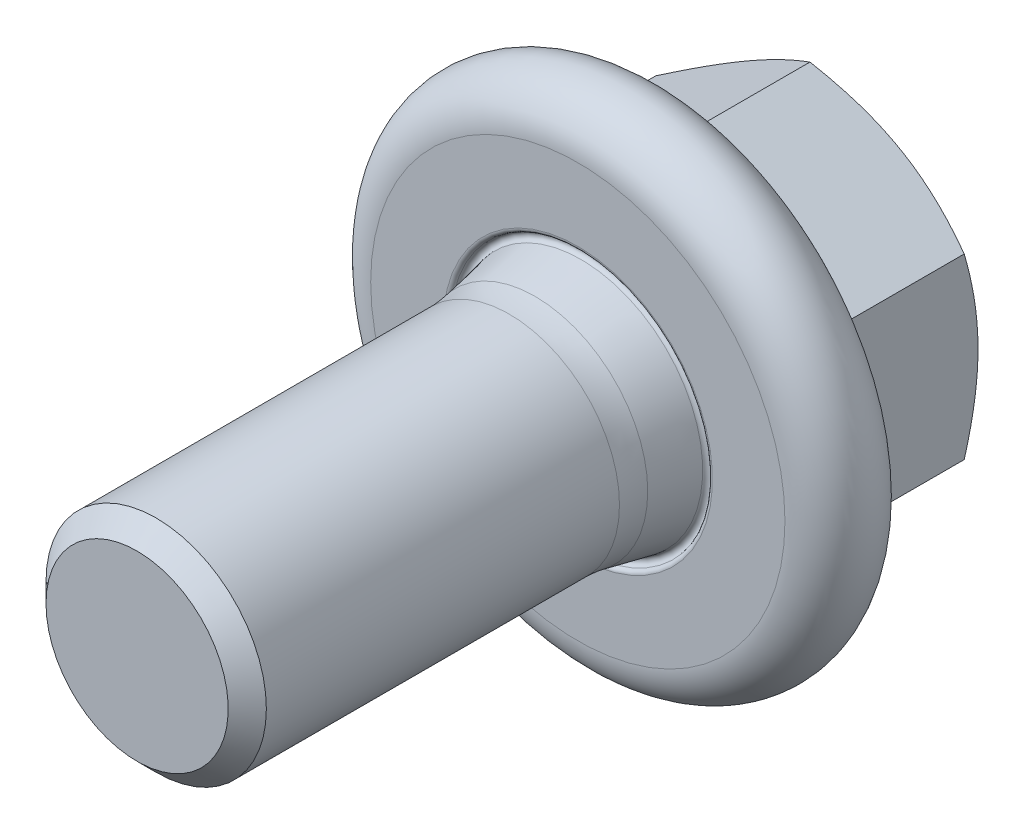
ISO-10303-21;
HEADER;
FILE_DESCRIPTION(('STEP AP214'),'2;1');
FILE_NAME('part.step','',(''),(''),'','','');
FILE_SCHEMA(('AUTOMOTIVE_DESIGN { 1 0 10303 214 1 1 1 1 }'));
ENDSEC;
DATA;
#1=APPLICATION_CONTEXT('core data for automotive mechanical design processes');
#2=APPLICATION_PROTOCOL_DEFINITION('international standard','automotive_design',2000,#1);
#3=PRODUCT_CONTEXT('',#1,'mechanical');
#4=PRODUCT('Part','Part','',(#3));
#5=PRODUCT_RELATED_PRODUCT_CATEGORY('part','',(#4));
#6=PRODUCT_DEFINITION_FORMATION('','',#4);
#7=PRODUCT_DEFINITION_CONTEXT('part definition',#1,'design');
#8=PRODUCT_DEFINITION('design','',#6,#7);
#9=PRODUCT_DEFINITION_SHAPE('','',#8);
#10=(LENGTH_UNIT() NAMED_UNIT(*) SI_UNIT(.MILLI.,.METRE.));
#11=(NAMED_UNIT(*) PLANE_ANGLE_UNIT() SI_UNIT($,.RADIAN.));
#12=(NAMED_UNIT(*) SI_UNIT($,.STERADIAN.) SOLID_ANGLE_UNIT());
#13=UNCERTAINTY_MEASURE_WITH_UNIT(LENGTH_MEASURE(1.E-05),#10,'distance_accuracy_value','');
#14=(GEOMETRIC_REPRESENTATION_CONTEXT(3) GLOBAL_UNCERTAINTY_ASSIGNED_CONTEXT((#13)) GLOBAL_UNIT_ASSIGNED_CONTEXT((#10,
#11,#12)) REPRESENTATION_CONTEXT('',''));
#15=CARTESIAN_POINT('',(0.,0.,0.));
#16=DIRECTION('',(0.,0.,1.));
#17=DIRECTION('',(1.,0.,0.));
#18=AXIS2_PLACEMENT_3D('',#15,#16,#17);
#19=CARTESIAN_POINT('',(175.672364397833,223.124440488105,-57.1634222254516));
#20=DIRECTION('',(-0.5,0.866025403784439,0.));
#21=DIRECTION('',(-0.866025403784439,-0.5,0.));
#22=AXIS2_PLACEMENT_3D('',#19,#20,#21);
#23=PLANE('',#22);
#24=CARTESIAN_POINT('',(177.422364397832,224.134803459186,-56.1672919098644));
#25=CARTESIAN_POINT('',(177.277421681038,224.051120742628,-56.1977599453541));
#26=CARTESIAN_POINT('',(177.132001035496,223.967162093779,-56.2254757929783));
#27=CARTESIAN_POINT('',(176.840214294002,223.798698940031,-56.2742374115386));
#28=CARTESIAN_POINT('',(176.693847549201,223.71419406052,-56.295277964156));
#29=CARTESIAN_POINT('',(176.40179278474,223.54557616364,-56.3293104094448));
#30=CARTESIAN_POINT('',(176.256111433559,223.46146699632,-56.3423765251649));
#31=CARTESIAN_POINT('',(175.964408088679,223.29305199163,-56.3599018466276));
#32=CARTESIAN_POINT('',(175.818386243256,223.208746239868,-56.3643642790468));
#33=CARTESIAN_POINT('',(175.526342552409,223.040134736342,-56.3643642790468));
#34=CARTESIAN_POINT('',(175.380320706986,222.955828984579,-56.3599018466276));
#35=CARTESIAN_POINT('',(175.088617362106,222.787413979889,-56.3423765251649));
#36=CARTESIAN_POINT('',(174.942936010925,222.703304812569,-56.3293104094448));
#37=CARTESIAN_POINT('',(174.650881246464,222.53468691569,-56.295277964156));
#38=CARTESIAN_POINT('',(174.504514501663,222.450182036178,-56.2742374115386));
#39=CARTESIAN_POINT('',(174.212727760169,222.281718882431,-56.2254757929783));
#40=CARTESIAN_POINT('',(174.067307114627,222.197760233581,-56.1977599453541));
#41=CARTESIAN_POINT('',(173.922364397833,222.114077517023,-56.1672919098643));
#42=B_SPLINE_CURVE_WITH_KNOTS('',3,(#24,#25,#26,#27,#28,#29,#30,#31,#32,#33,#34,#35,#36,#37,#38,
#39,#40,#41),.UNSPECIFIED.,.F.,.F.,(4,2,2,2,2,2,2,2,4),(0.,0.510400948319084,1.02119991788158,
1.52716902069188,2.03294833077693,2.538727640862,3.04469674367226,3.55549571323478,
4.06589666155388),.UNSPECIFIED.);
#43=CARTESIAN_POINT('',(177.422364397833,224.134803459186,-56.1672919098645));
#44=VERTEX_POINT('',#43);
#45=CARTESIAN_POINT('',(173.922364397833,222.114077517023,-56.1672919098644));
#46=VERTEX_POINT('',#45);
#47=EDGE_CURVE('E41',#44,#46,#42,.T.);
#48=ORIENTED_EDGE('',*,*,#47,.F.);
#49=DIRECTION('',(0.,0.,-1.));
#50=VECTOR('',#49,1.);
#51=CARTESIAN_POINT('',(177.422364397833,224.134803459186,-54.8634222254516));
#52=LINE('',#51,#50);
#53=CARTESIAN_POINT('',(177.422364397833,224.134803459186,-59.1306075748604));
#54=VERTEX_POINT('',#53);
#55=EDGE_CURVE('E11',#44,#54,#52,.T.);
#56=ORIENTED_EDGE('',*,*,#55,.T.);
#57=CARTESIAN_POINT('',(177.422364397832,224.134803459186,-59.1306075748602));
#58=CARTESIAN_POINT('',(177.268560594597,224.046004791986,-59.1818903708886));
#59=CARTESIAN_POINT('',(177.11342915912,223.956439615954,-59.2285293899348));
#60=CARTESIAN_POINT('',(176.800480291132,223.775758502778,-59.3099363969098));
#61=CARTESIAN_POINT('',(176.642657299934,223.684639356326,-59.3446755892685));
#62=CARTESIAN_POINT('',(176.328967138754,223.503530257327,-59.3987496467045));
#63=CARTESIAN_POINT('',(176.173148220504,223.41356816293,-59.4184444465656));
#64=CARTESIAN_POINT('',(175.860777587024,223.233220893603,-59.4419515306319));
#65=CARTESIAN_POINT('',(175.704227006398,223.142836373737,-59.4457832854053));
#66=CARTESIAN_POINT('',(175.41172904084,222.973962594585,-59.4377915670893));
#67=CARTESIAN_POINT('',(175.275737764206,222.895447994413,-59.4279303257317));
#68=CARTESIAN_POINT('',(175.004641149744,222.738930291077,-59.3966822986034));
#69=CARTESIAN_POINT('',(174.869536748868,222.660927728862,-59.375284849015));
#70=CARTESIAN_POINT('',(174.597881649815,222.504087584297,-59.3217953665181));
#71=CARTESIAN_POINT('',(174.461365315912,222.425269842169,-59.2894767009781));
#72=CARTESIAN_POINT('',(174.190368200324,222.268809584535,-59.2161269933913));
#73=CARTESIAN_POINT('',(174.055883949532,222.191165066139,-59.1751131745438));
#74=CARTESIAN_POINT('',(173.922364397833,222.114077517023,-59.1306075748602));
#75=B_SPLINE_CURVE_WITH_KNOTS('',3,(#57,#58,#59,#60,#61,#62,#63,#64,#65,#66,#67,#68,#69,#70,#71,
#72,#73,#74),.UNSPECIFIED.,.F.,.F.,(4,2,2,2,2,2,2,2,4),(0.,0.554778020224452,1.11088917979738,
1.65323831076753,2.19492155557112,2.66648861960565,3.13849233913992,3.62096283935476,
4.10248645365063),.UNSPECIFIED.);
#76=CARTESIAN_POINT('',(173.922364397833,222.114077517023,-59.1306075748603));
#77=VERTEX_POINT('',#76);
#78=EDGE_CURVE('E33',#54,#77,#75,.T.);
#79=ORIENTED_EDGE('',*,*,#78,.T.);
#80=DIRECTION('',(0.,0.,-1.));
#81=VECTOR('',#80,1.);
#82=CARTESIAN_POINT('',(173.922364397833,222.114077517023,-54.8634222254516));
#83=LINE('',#82,#81);
#84=EDGE_CURVE('E148',#46,#77,#83,.T.);
#85=ORIENTED_EDGE('',*,*,#84,.F.);
#86=EDGE_LOOP('',(#48,#56,#79,#85));
#87=FACE_BOUND('',#86,.T.);
#88=ADVANCED_FACE('F17',(#87),#23,.T.);
#89=CARTESIAN_POINT('',(173.922364397833,220.093351574859,-57.1634222254516));
#90=DIRECTION('',(-1.,0.,0.));
#91=DIRECTION('',(0.,-1.,0.));
#92=AXIS2_PLACEMENT_3D('',#89,#90,#91);
#93=PLANE('',#92);
#94=CARTESIAN_POINT('',(173.922364397833,222.114077517023,-56.1672919098644));
#95=CARTESIAN_POINT('',(173.922364397833,221.946712083907,-56.1977599453542));
#96=CARTESIAN_POINT('',(173.922364397833,221.778794786208,-56.2254757929784));
#97=CARTESIAN_POINT('',(173.922364397833,221.441868478712,-56.2742374115387));
#98=CARTESIAN_POINT('',(173.922364397833,221.27285871969,-56.2952779641561));
#99=CARTESIAN_POINT('',(173.922364397833,220.93562292593,-56.3293104094449));
#100=CARTESIAN_POINT('',(173.922364397833,220.76740459129,-56.342376525165));
#101=CARTESIAN_POINT('',(173.922364397833,220.43057458191,-56.3599018466277));
#102=CARTESIAN_POINT('',(173.922364397833,220.261963078385,-56.364364279047));
#103=CARTESIAN_POINT('',(173.922364397833,219.924740071333,-56.364364279047));
#104=CARTESIAN_POINT('',(173.922364397833,219.756128567808,-56.3599018466277));
#105=CARTESIAN_POINT('',(173.922364397833,219.419298558428,-56.342376525165));
#106=CARTESIAN_POINT('',(173.922364397833,219.251080223788,-56.3293104094449));
#107=CARTESIAN_POINT('',(173.922364397833,218.913844430028,-56.2952779641561));
#108=CARTESIAN_POINT('',(173.922364397833,218.744834671006,-56.2742374115387));
#109=CARTESIAN_POINT('',(173.922364397833,218.40790836351,-56.2254757929784));
#110=CARTESIAN_POINT('',(173.922364397833,218.239991065811,-56.1977599453542));
#111=CARTESIAN_POINT('',(173.922364397833,218.072625632695,-56.1672919098644));
#112=B_SPLINE_CURVE_WITH_KNOTS('',3,(#94,#95,#96,#97,#98,#99,#100,#101,#102,#103,#104,#105,#106,
#107,#108,#109,#110,#111),.UNSPECIFIED.,.F.,.F.,(4,2,2,2,2,2,2,2,4),(0.,0.510400948319248,
1.02119991788192,1.52716902069235,2.03294833077754,2.53872764086272,3.04469674367312,
3.5554957132358,4.06589666155504),.UNSPECIFIED.);
#113=CARTESIAN_POINT('',(173.922364397833,218.072625632695,-56.1672919098644));
#114=VERTEX_POINT('',#113);
#115=EDGE_CURVE('E255',#46,#114,#112,.T.);
#116=ORIENTED_EDGE('',*,*,#115,.F.);
#117=ORIENTED_EDGE('',*,*,#84,.T.);
#118=CARTESIAN_POINT('',(173.922364397833,222.114077517023,-59.1306075748603));
#119=CARTESIAN_POINT('',(173.922364397833,221.936480182622,-59.1818903708887));
#120=CARTESIAN_POINT('',(173.922364397833,221.757349830558,-59.2285293899349));
#121=CARTESIAN_POINT('',(173.922364397833,221.395987604206,-59.3099363969099));
#122=CARTESIAN_POINT('',(173.922364397833,221.213749311302,-59.3446755892687));
#123=CARTESIAN_POINT('',(173.922364397833,220.851531113303,-59.3987496467047));
#124=CARTESIAN_POINT('',(173.922364397833,220.671606924509,-59.4184444465658));
#125=CARTESIAN_POINT('',(173.922364397833,220.310912385856,-59.4419515306321));
#126=CARTESIAN_POINT('',(173.922364397833,220.130143346124,-59.4457832854055));
#127=CARTESIAN_POINT('',(173.922364397833,219.79239578782,-59.4377915670895));
#128=CARTESIAN_POINT('',(173.922364397833,219.635366587475,-59.4279303257319));
#129=CARTESIAN_POINT('',(173.922364397833,219.322331180803,-59.3966822986036));
#130=CARTESIAN_POINT('',(173.922364397833,219.166326056374,-59.3752848490152));
#131=CARTESIAN_POINT('',(173.922364397833,218.852645767243,-59.3217953665183));
#132=CARTESIAN_POINT('',(173.922364397833,218.695010282988,-59.2894767009783));
#133=CARTESIAN_POINT('',(173.922364397833,218.38208976772,-59.2161269933915));
#134=CARTESIAN_POINT('',(173.922364397833,218.226800730926,-59.175113174544));
#135=CARTESIAN_POINT('',(173.922364397833,218.072625632695,-59.1306075748603));
#136=B_SPLINE_CURVE_WITH_KNOTS('',3,(#118,#119,#120,#121,#122,#123,#124,#125,#126,#127,#128,
#129,#130,#131,#132,#133,#134,#135),.UNSPECIFIED.,.F.,.F.,(4,2,2,2,2,2,2,2,4),(0.,
0.554778020224542,1.11088917979751,1.65323831076771,2.19492155557136,2.66648861960611,
3.1384923391406,3.62096283935568,4.10248645365181),.UNSPECIFIED.);
#137=CARTESIAN_POINT('',(173.922364397833,218.072625632695,-59.1306075748603));
#138=VERTEX_POINT('',#137);
#139=EDGE_CURVE('E150',#77,#138,#136,.T.);
#140=ORIENTED_EDGE('',*,*,#139,.T.);
#141=DIRECTION('',(0.,0.,-1.));
#142=VECTOR('',#141,1.);
#143=CARTESIAN_POINT('',(173.922364397833,218.072625632695,-54.8634222254516));
#144=LINE('',#143,#142);
#145=EDGE_CURVE('E159',#114,#138,#144,.T.);
#146=ORIENTED_EDGE('',*,*,#145,.F.);
#147=EDGE_LOOP('',(#116,#117,#140,#146));
#148=FACE_BOUND('',#147,.T.);
#149=ADVANCED_FACE('F260',(#148),#93,.T.);
#150=CARTESIAN_POINT('',(175.672364397833,217.062262661613,-57.1634222254516));
#151=DIRECTION('',(-0.5,-0.866025403784439,0.));
#152=DIRECTION('',(0.866025403784439,-0.5,0.));
#153=AXIS2_PLACEMENT_3D('',#150,#151,#152);
#154=PLANE('',#153);
#155=CARTESIAN_POINT('',(173.922364397833,218.072625632695,-56.1672919098643));
#156=CARTESIAN_POINT('',(174.067307114627,217.988942916137,-56.1977599453541));
#157=CARTESIAN_POINT('',(174.212727760169,217.904984267287,-56.2254757929783));
#158=CARTESIAN_POINT('',(174.504514501663,217.73652111354,-56.2742374115386));
#159=CARTESIAN_POINT('',(174.650881246464,217.652016234028,-56.295277964156));
#160=CARTESIAN_POINT('',(174.942936010925,217.483398337149,-56.3293104094448));
#161=CARTESIAN_POINT('',(175.088617362106,217.399289169828,-56.3423765251649));
#162=CARTESIAN_POINT('',(175.380320706986,217.230874165139,-56.3599018466276));
#163=CARTESIAN_POINT('',(175.52634255241,217.146568413376,-56.3643642790468));
#164=CARTESIAN_POINT('',(175.818386243256,216.97795690985,-56.3643642790468));
#165=CARTESIAN_POINT('',(175.96440808868,216.893651158087,-56.3599018466275));
#166=CARTESIAN_POINT('',(176.25611143356,216.725236153398,-56.3423765251649));
#167=CARTESIAN_POINT('',(176.401792784741,216.641126986077,-56.3293104094448));
#168=CARTESIAN_POINT('',(176.693847549202,216.472509089198,-56.2952779641559));
#169=CARTESIAN_POINT('',(176.840214294003,216.388004209686,-56.2742374115385));
#170=CARTESIAN_POINT('',(177.132001035497,216.219541055939,-56.2254757929782));
#171=CARTESIAN_POINT('',(177.277421681039,216.135582407089,-56.197759945354));
#172=CARTESIAN_POINT('',(177.422364397833,216.051899690531,-56.1672919098643));
#173=B_SPLINE_CURVE_WITH_KNOTS('',3,(#155,#156,#157,#158,#159,#160,#161,#162,#163,#164,#165,
#166,#167,#168,#169,#170,#171,#172),.UNSPECIFIED.,.F.,.F.,(4,2,2,2,2,2,2,2,4),(0.,
0.510400948319208,1.02119991788178,1.52716902069214,2.03294833077729,2.53872764086245,
3.04469674367281,3.55549571323537,4.06589666155458),.UNSPECIFIED.);
#174=CARTESIAN_POINT('',(177.422364397833,216.051899690531,-56.1672919098642));
#175=VERTEX_POINT('',#174);
#176=EDGE_CURVE('E228',#114,#175,#173,.T.);
#177=ORIENTED_EDGE('',*,*,#176,.F.);
#178=ORIENTED_EDGE('',*,*,#145,.T.);
#179=CARTESIAN_POINT('',(173.922364397833,218.072625632695,-59.1306075748602));
#180=CARTESIAN_POINT('',(174.076168201068,217.983826965495,-59.1818903708886));
#181=CARTESIAN_POINT('',(174.231299636545,217.894261789462,-59.2285293899348));
#182=CARTESIAN_POINT('',(174.544248504534,217.713580676286,-59.3099363969097));
#183=CARTESIAN_POINT('',(174.702071495731,217.622461529834,-59.3446755892685));
#184=CARTESIAN_POINT('',(175.015761656911,217.441352430835,-59.3987496467045));
#185=CARTESIAN_POINT('',(175.171580575162,217.351390336438,-59.4184444465656));
#186=CARTESIAN_POINT('',(175.483951208642,217.171043067112,-59.4419515306319));
#187=CARTESIAN_POINT('',(175.640501789267,217.080658547245,-59.4457832854053));
#188=CARTESIAN_POINT('',(175.932999754825,216.911784768093,-59.4377915670893));
#189=CARTESIAN_POINT('',(176.06899103146,216.833270167921,-59.4279303257317));
#190=CARTESIAN_POINT('',(176.340087645921,216.676752464585,-59.3966822986034));
#191=CARTESIAN_POINT('',(176.475192046797,216.598749902371,-59.3752848490149));
#192=CARTESIAN_POINT('',(176.746847145851,216.441909757805,-59.321795366518));
#193=CARTESIAN_POINT('',(176.883363479754,216.363092015677,-59.2894767009781));
#194=CARTESIAN_POINT('',(177.154360595342,216.206631758043,-59.2161269933912));
#195=CARTESIAN_POINT('',(177.288844846134,216.128987239647,-59.1751131745437));
#196=CARTESIAN_POINT('',(177.422364397833,216.051899690531,-59.1306075748601));
#197=B_SPLINE_CURVE_WITH_KNOTS('',3,(#179,#180,#181,#182,#183,#184,#185,#186,#187,#188,#189,
#190,#191,#192,#193,#194,#195,#196),.UNSPECIFIED.,.F.,.F.,(4,2,2,2,2,2,2,2,4),(0.,
0.554778020224571,1.11088917979756,1.6532383107678,2.19492155557139,2.66648861960602,
3.13849233914041,3.62096283935532,4.10248645365134),.UNSPECIFIED.);
#198=CARTESIAN_POINT('',(177.422364397833,216.051899690531,-59.1306075748601));
#199=VERTEX_POINT('',#198);
#200=EDGE_CURVE('E158',#138,#199,#197,.T.);
#201=ORIENTED_EDGE('',*,*,#200,.T.);
#202=DIRECTION('',(0.,0.,-1.));
#203=VECTOR('',#202,1.);
#204=CARTESIAN_POINT('',(177.422364397833,216.051899690531,-54.8634222254516));
#205=LINE('',#204,#203);
#206=EDGE_CURVE('E156',#175,#199,#205,.T.);
#207=ORIENTED_EDGE('',*,*,#206,.F.);
#208=EDGE_LOOP('',(#177,#178,#201,#207));
#209=FACE_BOUND('',#208,.T.);
#210=ADVANCED_FACE('F219',(#209),#154,.T.);
#211=CARTESIAN_POINT('',(179.172364397833,217.062262661613,-57.1634222254516));
#212=DIRECTION('',(0.5,-0.866025403784439,0.));
#213=DIRECTION('',(0.866025403784439,0.5,0.));
#214=AXIS2_PLACEMENT_3D('',#211,#212,#213);
#215=PLANE('',#214);
#216=CARTESIAN_POINT('',(177.422364397833,216.051899690531,-56.1672919098643));
#217=CARTESIAN_POINT('',(177.567307114627,216.135582407089,-56.197759945354));
#218=CARTESIAN_POINT('',(177.712727760169,216.219541055939,-56.2254757929782));
#219=CARTESIAN_POINT('',(178.004514501663,216.388004209686,-56.2742374115385));
#220=CARTESIAN_POINT('',(178.150881246464,216.472509089198,-56.2952779641559));
#221=CARTESIAN_POINT('',(178.442936010925,216.641126986077,-56.3293104094448));
#222=CARTESIAN_POINT('',(178.588617362106,216.725236153398,-56.3423765251649));
#223=CARTESIAN_POINT('',(178.880320706986,216.893651158087,-56.3599018466275));
#224=CARTESIAN_POINT('',(179.02634255241,216.97795690985,-56.3643642790468));
#225=CARTESIAN_POINT('',(179.318386243256,217.146568413376,-56.3643642790468));
#226=CARTESIAN_POINT('',(179.46440808868,217.230874165139,-56.3599018466276));
#227=CARTESIAN_POINT('',(179.75611143356,217.399289169828,-56.3423765251649));
#228=CARTESIAN_POINT('',(179.901792784741,217.483398337149,-56.3293104094448));
#229=CARTESIAN_POINT('',(180.193847549202,217.652016234028,-56.295277964156));
#230=CARTESIAN_POINT('',(180.340214294003,217.73652111354,-56.2742374115386));
#231=CARTESIAN_POINT('',(180.632001035497,217.904984267287,-56.2254757929783));
#232=CARTESIAN_POINT('',(180.777421681039,217.988942916137,-56.1977599453541));
#233=CARTESIAN_POINT('',(180.922364397833,218.072625632695,-56.1672919098643));
#234=B_SPLINE_CURVE_WITH_KNOTS('',3,(#216,#217,#218,#219,#220,#221,#222,#223,#224,#225,#226,
#227,#228,#229,#230,#231,#232,#233),.UNSPECIFIED.,.F.,.F.,(4,2,2,2,2,2,2,2,4),(0.,
0.510400948319211,1.02119991788178,1.52716902069214,2.03294833077729,2.53872764086244,
3.0446967436728,3.55549571323537,4.06589666155458),.UNSPECIFIED.);
#235=CARTESIAN_POINT('',(180.922364397833,218.072625632695,-56.1672919098644));
#236=VERTEX_POINT('',#235);
#237=EDGE_CURVE('E64',#175,#236,#234,.T.);
#238=ORIENTED_EDGE('',*,*,#237,.F.);
#239=ORIENTED_EDGE('',*,*,#206,.T.);
#240=CARTESIAN_POINT('',(177.422364397833,216.051899690531,-59.1306075748601));
#241=CARTESIAN_POINT('',(177.576168201068,216.140698357731,-59.1818903708885));
#242=CARTESIAN_POINT('',(177.731299636545,216.230263533764,-59.2285293899347));
#243=CARTESIAN_POINT('',(178.044248504534,216.41094464694,-59.3099363969096));
#244=CARTESIAN_POINT('',(178.202071495731,216.502063793392,-59.3446755892685));
#245=CARTESIAN_POINT('',(178.515761656911,216.683172892391,-59.3987496467045));
#246=CARTESIAN_POINT('',(178.671580575162,216.773134986788,-59.4184444465656));
#247=CARTESIAN_POINT('',(178.983951208642,216.953482256114,-59.4419515306319));
#248=CARTESIAN_POINT('',(179.140501789267,217.043866775981,-59.4457832854053));
#249=CARTESIAN_POINT('',(179.432999754825,217.212740555133,-59.4377915670893));
#250=CARTESIAN_POINT('',(179.56899103146,217.291255155305,-59.4279303257317));
#251=CARTESIAN_POINT('',(179.840087645921,217.447772858641,-59.3966822986034));
#252=CARTESIAN_POINT('',(179.975192046797,217.525775420855,-59.375284849015));
#253=CARTESIAN_POINT('',(180.246847145851,217.682615565421,-59.3217953665181));
#254=CARTESIAN_POINT('',(180.383363479754,217.761433307549,-59.2894767009781));
#255=CARTESIAN_POINT('',(180.654360595342,217.917893565183,-59.2161269933913));
#256=CARTESIAN_POINT('',(180.788844846134,217.995538083579,-59.1751131745438));
#257=CARTESIAN_POINT('',(180.922364397833,218.072625632695,-59.1306075748602));
#258=B_SPLINE_CURVE_WITH_KNOTS('',3,(#240,#241,#242,#243,#244,#245,#246,#247,#248,#249,#250,
#251,#252,#253,#254,#255,#256,#257),.UNSPECIFIED.,.F.,.F.,(4,2,2,2,2,2,2,2,4),(0.,
0.554778020224571,1.11088917979757,1.65323831076781,2.19492155557142,2.66648861960603,
3.13849233914041,3.62096283935532,4.10248645365134),.UNSPECIFIED.);
#259=CARTESIAN_POINT('',(180.922364397833,218.072625632695,-59.1306075748602));
#260=VERTEX_POINT('',#259);
#261=EDGE_CURVE('E155',#199,#260,#258,.T.);
#262=ORIENTED_EDGE('',*,*,#261,.T.);
#263=DIRECTION('',(0.,0.,-1.));
#264=VECTOR('',#263,1.);
#265=CARTESIAN_POINT('',(180.922364397833,218.072625632695,-54.8634222254516));
#266=LINE('',#265,#264);
#267=EDGE_CURVE('E153',#236,#260,#266,.T.);
#268=ORIENTED_EDGE('',*,*,#267,.F.);
#269=EDGE_LOOP('',(#238,#239,#262,#268));
#270=FACE_BOUND('',#269,.T.);
#271=ADVANCED_FACE('F214',(#270),#215,.T.);
#272=CARTESIAN_POINT('',(180.922364397833,220.093351574859,-57.1634222254516));
#273=DIRECTION('',(1.,0.,0.));
#274=DIRECTION('',(0.,1.,0.));
#275=AXIS2_PLACEMENT_3D('',#272,#273,#274);
#276=PLANE('',#275);
#277=CARTESIAN_POINT('',(180.922364397833,218.072625632695,-56.1672919098644));
#278=CARTESIAN_POINT('',(180.922364397833,218.239991065811,-56.1977599453542));
#279=CARTESIAN_POINT('',(180.922364397833,218.40790836351,-56.2254757929784));
#280=CARTESIAN_POINT('',(180.922364397833,218.744834671006,-56.2742374115387));
#281=CARTESIAN_POINT('',(180.922364397833,218.913844430028,-56.2952779641561));
#282=CARTESIAN_POINT('',(180.922364397833,219.251080223788,-56.3293104094449));
#283=CARTESIAN_POINT('',(180.922364397833,219.419298558428,-56.342376525165));
#284=CARTESIAN_POINT('',(180.922364397833,219.756128567808,-56.3599018466277));
#285=CARTESIAN_POINT('',(180.922364397833,219.924740071333,-56.364364279047));
#286=CARTESIAN_POINT('',(180.922364397833,220.261963078385,-56.364364279047));
#287=CARTESIAN_POINT('',(180.922364397833,220.43057458191,-56.3599018466277));
#288=CARTESIAN_POINT('',(180.922364397833,220.76740459129,-56.342376525165));
#289=CARTESIAN_POINT('',(180.922364397833,220.93562292593,-56.3293104094449));
#290=CARTESIAN_POINT('',(180.922364397833,221.27285871969,-56.2952779641561));
#291=CARTESIAN_POINT('',(180.922364397833,221.441868478712,-56.2742374115387));
#292=CARTESIAN_POINT('',(180.922364397833,221.778794786208,-56.2254757929784));
#293=CARTESIAN_POINT('',(180.922364397833,221.946712083907,-56.1977599453542));
#294=CARTESIAN_POINT('',(180.922364397833,222.114077517023,-56.1672919098644));
#295=B_SPLINE_CURVE_WITH_KNOTS('',3,(#277,#278,#279,#280,#281,#282,#283,#284,#285,#286,#287,
#288,#289,#290,#291,#292,#293,#294),.UNSPECIFIED.,.F.,.F.,(4,2,2,2,2,2,2,2,4),(0.,
0.510400948319248,1.02119991788192,1.52716902069233,2.03294833077751,2.53872764086272,
3.04469674367315,3.55549571323582,4.06589666155504),.UNSPECIFIED.);
#296=CARTESIAN_POINT('',(180.922364397833,222.114077517023,-56.1672919098644));
#297=VERTEX_POINT('',#296);
#298=EDGE_CURVE('E21',#236,#297,#295,.T.);
#299=ORIENTED_EDGE('',*,*,#298,.F.);
#300=ORIENTED_EDGE('',*,*,#267,.T.);
#301=CARTESIAN_POINT('',(180.922364397833,218.072625632695,-59.1306075748603));
#302=CARTESIAN_POINT('',(180.922364397833,218.250222967096,-59.1818903708887));
#303=CARTESIAN_POINT('',(180.922364397833,218.42935331916,-59.2285293899349));
#304=CARTESIAN_POINT('',(180.922364397833,218.790715545512,-59.3099363969099));
#305=CARTESIAN_POINT('',(180.922364397833,218.972953838416,-59.3446755892687));
#306=CARTESIAN_POINT('',(180.922364397833,219.335172036415,-59.3987496467047));
#307=CARTESIAN_POINT('',(180.922364397833,219.515096225209,-59.4184444465658));
#308=CARTESIAN_POINT('',(180.922364397833,219.875790763862,-59.4419515306321));
#309=CARTESIAN_POINT('',(180.922364397833,220.056559803594,-59.4457832854055));
#310=CARTESIAN_POINT('',(180.922364397833,220.394307361898,-59.4377915670895));
#311=CARTESIAN_POINT('',(180.922364397833,220.551336562243,-59.4279303257319));
#312=CARTESIAN_POINT('',(180.922364397833,220.864371968915,-59.3966822986036));
#313=CARTESIAN_POINT('',(180.922364397833,221.020377093344,-59.3752848490152));
#314=CARTESIAN_POINT('',(180.922364397833,221.334057382475,-59.3217953665183));
#315=CARTESIAN_POINT('',(180.922364397833,221.49169286673,-59.2894767009783));
#316=CARTESIAN_POINT('',(180.922364397833,221.804613381998,-59.2161269933914));
#317=CARTESIAN_POINT('',(180.922364397833,221.959902418792,-59.1751131745439));
#318=CARTESIAN_POINT('',(180.922364397833,222.114077517023,-59.1306075748603));
#319=B_SPLINE_CURVE_WITH_KNOTS('',3,(#301,#302,#303,#304,#305,#306,#307,#308,#309,#310,#311,
#312,#313,#314,#315,#316,#317,#318),.UNSPECIFIED.,.F.,.F.,(4,2,2,2,2,2,2,2,4),(0.,
0.554778020224544,1.11088917979754,1.65323831076774,2.19492155557139,2.66648861960614,
3.13849233914063,3.62096283935568,4.10248645365181),.UNSPECIFIED.);
#320=CARTESIAN_POINT('',(180.922364397833,222.114077517023,-59.1306075748603));
#321=VERTEX_POINT('',#320);
#322=EDGE_CURVE('E152',#260,#321,#319,.T.);
#323=ORIENTED_EDGE('',*,*,#322,.T.);
#324=DIRECTION('',(0.,0.,-1.));
#325=VECTOR('',#324,1.);
#326=CARTESIAN_POINT('',(180.922364397833,222.114077517023,-54.8634222254516));
#327=LINE('',#326,#325);
#328=EDGE_CURVE('E73',#297,#321,#327,.T.);
#329=ORIENTED_EDGE('',*,*,#328,.F.);
#330=EDGE_LOOP('',(#299,#300,#323,#329));
#331=FACE_BOUND('',#330,.T.);
#332=ADVANCED_FACE('F211',(#331),#276,.T.);
#333=CARTESIAN_POINT('',(179.172364397833,223.124440488105,-57.1634222254516));
#334=DIRECTION('',(0.5,0.866025403784439,0.));
#335=DIRECTION('',(-0.866025403784439,0.5,0.));
#336=AXIS2_PLACEMENT_3D('',#333,#334,#335);
#337=PLANE('',#336);
#338=CARTESIAN_POINT('',(180.922364397833,222.114077517023,-56.1672919098643));
#339=CARTESIAN_POINT('',(180.777421681039,222.197760233581,-56.1977599453541));
#340=CARTESIAN_POINT('',(180.632001035497,222.281718882431,-56.2254757929783));
#341=CARTESIAN_POINT('',(180.340214294003,222.450182036178,-56.2742374115386));
#342=CARTESIAN_POINT('',(180.193847549202,222.53468691569,-56.295277964156));
#343=CARTESIAN_POINT('',(179.901792784741,222.703304812569,-56.3293104094448));
#344=CARTESIAN_POINT('',(179.75611143356,222.787413979889,-56.3423765251649));
#345=CARTESIAN_POINT('',(179.46440808868,222.955828984579,-56.3599018466275));
#346=CARTESIAN_POINT('',(179.318386243257,223.040134736342,-56.3643642790468));
#347=CARTESIAN_POINT('',(179.02634255241,223.208746239868,-56.3643642790468));
#348=CARTESIAN_POINT('',(178.880320706987,223.29305199163,-56.3599018466276));
#349=CARTESIAN_POINT('',(178.588617362107,223.46146699632,-56.3423765251649));
#350=CARTESIAN_POINT('',(178.442936010926,223.54557616364,-56.3293104094448));
#351=CARTESIAN_POINT('',(178.150881246465,223.71419406052,-56.295277964156));
#352=CARTESIAN_POINT('',(178.004514501664,223.798698940031,-56.2742374115386));
#353=CARTESIAN_POINT('',(177.71272776017,223.967162093779,-56.2254757929783));
#354=CARTESIAN_POINT('',(177.567307114628,224.051120742628,-56.1977599453541));
#355=CARTESIAN_POINT('',(177.422364397833,224.134803459186,-56.1672919098644));
#356=B_SPLINE_CURVE_WITH_KNOTS('',3,(#338,#339,#340,#341,#342,#343,#344,#345,#346,#347,#348,
#349,#350,#351,#352,#353,#354,#355),.UNSPECIFIED.,.F.,.F.,(4,2,2,2,2,2,2,2,4),(0.,
0.510400948319096,1.02119991788162,1.52716902069186,2.03294833077695,2.53872764086202,
3.04469674367229,3.55549571323479,4.06589666155388),.UNSPECIFIED.);
#357=EDGE_CURVE('E121',#297,#44,#356,.T.);
#358=ORIENTED_EDGE('',*,*,#357,.F.);
#359=ORIENTED_EDGE('',*,*,#328,.T.);
#360=CARTESIAN_POINT('',(180.922364397833,222.114077517023,-59.1306075748602));
#361=CARTESIAN_POINT('',(180.768560594598,222.202876184223,-59.1818903708886));
#362=CARTESIAN_POINT('',(180.613429159121,222.292441360256,-59.2285293899348));
#363=CARTESIAN_POINT('',(180.300480291132,222.473122473432,-59.3099363969097));
#364=CARTESIAN_POINT('',(180.142657299935,222.564241619884,-59.3446755892685));
#365=CARTESIAN_POINT('',(179.828967138755,222.745350718883,-59.3987496467045));
#366=CARTESIAN_POINT('',(179.673148220504,222.83531281328,-59.4184444465656));
#367=CARTESIAN_POINT('',(179.360777587024,223.015660082607,-59.4419515306319));
#368=CARTESIAN_POINT('',(179.204227006399,223.106044602473,-59.4457832854053));
#369=CARTESIAN_POINT('',(178.911729040841,223.274918381625,-59.4377915670893));
#370=CARTESIAN_POINT('',(178.775737764206,223.353432981797,-59.4279303257317));
#371=CARTESIAN_POINT('',(178.504641149745,223.509950685133,-59.3966822986034));
#372=CARTESIAN_POINT('',(178.369536748869,223.587953247347,-59.375284849015));
#373=CARTESIAN_POINT('',(178.097881649815,223.744793391913,-59.3217953665181));
#374=CARTESIAN_POINT('',(177.961365315912,223.82361113404,-59.2894767009781));
#375=CARTESIAN_POINT('',(177.690368200325,223.980071391674,-59.2161269933913));
#376=CARTESIAN_POINT('',(177.555883949533,224.057715910071,-59.1751131745438));
#377=CARTESIAN_POINT('',(177.422364397833,224.134803459186,-59.1306075748602));
#378=B_SPLINE_CURVE_WITH_KNOTS('',3,(#360,#361,#362,#363,#364,#365,#366,#367,#368,#369,#370,
#371,#372,#373,#374,#375,#376,#377),.UNSPECIFIED.,.F.,.F.,(4,2,2,2,2,2,2,2,4),(0.,
0.554778020224545,1.11088917979756,1.65323831076777,2.19492155557138,2.66648861960582,
3.13849233914004,3.62096283935482,4.10248645365063),.UNSPECIFIED.);
#379=EDGE_CURVE('E116',#321,#54,#378,.T.);
#380=ORIENTED_EDGE('',*,*,#379,.T.);
#381=ORIENTED_EDGE('',*,*,#55,.F.);
#382=EDGE_LOOP('',(#358,#359,#380,#381));
#383=FACE_BOUND('',#382,.T.);
#384=ADVANCED_FACE('F181',(#383),#337,.T.);
#385=CARTESIAN_POINT('',(177.422364397833,220.093351574859,-61.4639409081937));
#386=DIRECTION('',(0.,0.,1.));
#387=DIRECTION('',(1.,0.,0.));
#388=AXIS2_PLACEMENT_3D('',#385,#386,#387);
#389=CONICAL_SURFACE('',#388,0.,1.0471975511966);
#390=ORIENTED_EDGE('',*,*,#78,.F.);
#391=ORIENTED_EDGE('',*,*,#379,.F.);
#392=ORIENTED_EDGE('',*,*,#322,.F.);
#393=ORIENTED_EDGE('',*,*,#261,.F.);
#394=ORIENTED_EDGE('',*,*,#200,.F.);
#395=ORIENTED_EDGE('',*,*,#139,.F.);
#396=EDGE_LOOP('',(#390,#391,#392,#393,#394,#395));
#397=FACE_BOUND('',#396,.T.);
#398=CARTESIAN_POINT('',(177.422364397833,220.093351574859,-59.4634222254516));
#399=DIRECTION('',(0.,0.,-1.));
#400=DIRECTION('',(1.,0.,0.));
#401=AXIS2_PLACEMENT_3D('',#398,#399,#400);
#402=CIRCLE('',#401,3.465);
#403=CARTESIAN_POINT('',(180.887364397833,220.093351574859,-59.4634222254516));
#404=VERTEX_POINT('',#403);
#405=EDGE_CURVE('E113',#404,#404,#402,.T.);
#406=ORIENTED_EDGE('',*,*,#405,.F.);
#407=EDGE_LOOP('',(#406));
#408=FACE_BOUND('',#407,.T.);
#409=ADVANCED_FACE('F114',(#397,#408),#389,.T.);
#410=CARTESIAN_POINT('',(177.422364397833,220.093351574859,-59.4634222254516));
#411=DIRECTION('',(0.,0.,-1.));
#412=DIRECTION('',(-1.,0.,0.));
#413=AXIS2_PLACEMENT_3D('',#410,#411,#412);
#414=PLANE('',#413);
#415=ORIENTED_EDGE('',*,*,#405,.T.);
#416=EDGE_LOOP('',(#415));
#417=FACE_BOUND('',#416,.T.);
#418=ADVANCED_FACE('F180',(#417),#414,.T.);
#419=CARTESIAN_POINT('',(177.422364397833,220.093351574859,-53.8634222254516));
#420=DIRECTION('',(0.,0.,1.));
#421=DIRECTION('',(1.,0.,0.));
#422=AXIS2_PLACEMENT_3D('',#419,#420,#421);
#423=PLANE('',#422);
#424=CARTESIAN_POINT('',(177.422364397833,220.093351574859,-53.8634222254516));
#425=DIRECTION('',(0.,0.,1.));
#426=DIRECTION('',(-1.,0.,0.));
#427=AXIS2_PLACEMENT_3D('',#424,#425,#426);
#428=CIRCLE('',#427,3.05551918177834);
#429=CARTESIAN_POINT('',(174.366845216055,220.093351574859,-53.8634222254516));
#430=VERTEX_POINT('',#429);
#431=EDGE_CURVE('E124',#430,#430,#428,.T.);
#432=ORIENTED_EDGE('',*,*,#431,.F.);
#433=EDGE_LOOP('',(#432));
#434=FACE_BOUND('',#433,.T.);
#435=CARTESIAN_POINT('',(177.422364397833,220.093351574859,-53.8634222254516));
#436=DIRECTION('',(0.,0.,1.));
#437=DIRECTION('',(-1.,0.,0.));
#438=AXIS2_PLACEMENT_3D('',#435,#436,#437);
#439=CIRCLE('',#438,4.7);
#440=CARTESIAN_POINT('',(172.722364397833,220.093351574859,-53.8634222254516));
#441=VERTEX_POINT('',#440);
#442=EDGE_CURVE('E117',#441,#441,#439,.T.);
#443=ORIENTED_EDGE('',*,*,#442,.T.);
#444=EDGE_LOOP('',(#443));
#445=FACE_BOUND('',#444,.T.);
#446=ADVANCED_FACE('F239',(#434,#445),#423,.T.);
#447=CARTESIAN_POINT('',(177.422364397833,220.093351574859,-56.6634222254516));
#448=DIRECTION('',(0.,0.,1.));
#449=DIRECTION('',(1.,0.,0.));
#450=AXIS2_PLACEMENT_3D('',#447,#448,#449);
#451=CONICAL_SURFACE('',#450,2.67834504514476,1.22173047639603);
#452=ORIENTED_EDGE('',*,*,#357,.T.);
#453=ORIENTED_EDGE('',*,*,#47,.T.);
#454=ORIENTED_EDGE('',*,*,#115,.T.);
#455=ORIENTED_EDGE('',*,*,#176,.T.);
#456=ORIENTED_EDGE('',*,*,#237,.T.);
#457=ORIENTED_EDGE('',*,*,#298,.T.);
#458=EDGE_LOOP('',(#452,#453,#454,#455,#456,#457));
#459=FACE_BOUND('',#458,.T.);
#460=CARTESIAN_POINT('',(177.422364397833,220.093351574859,-55.8031148462375));
#461=DIRECTION('',(0.,0.,-1.));
#462=DIRECTION('',(1.,0.,0.));
#463=AXIS2_PLACEMENT_3D('',#460,#461,#462);
#464=CIRCLE('',#463,5.04202014332566);
#465=CARTESIAN_POINT('',(182.464384541159,220.093351574859,-55.8031148462375));
#466=VERTEX_POINT('',#465);
#467=EDGE_CURVE('E129',#466,#466,#464,.T.);
#468=ORIENTED_EDGE('',*,*,#467,.T.);
#469=EDGE_LOOP('',(#468));
#470=FACE_BOUND('',#469,.T.);
#471=ADVANCED_FACE('F234',(#459,#470),#451,.T.);
#472=CARTESIAN_POINT('',(177.422364397833,220.093351574859,-54.8634222254516));
#473=DIRECTION('',(0.,0.,1.));
#474=DIRECTION('',(1.,0.,0.));
#475=AXIS2_PLACEMENT_3D('',#472,#473,#474);
#476=TOROIDAL_SURFACE('',#475,4.7,1.);
#477=ORIENTED_EDGE('',*,*,#442,.F.);
#478=EDGE_LOOP('',(#477));
#479=FACE_BOUND('',#478,.T.);
#480=ORIENTED_EDGE('',*,*,#467,.F.);
#481=EDGE_LOOP('',(#480));
#482=FACE_BOUND('',#481,.T.);
#483=ADVANCED_FACE('F238',(#479,#482),#476,.T.);
#484=CARTESIAN_POINT('',(177.422364397833,220.093351574859,-53.9134222254516));
#485=DIRECTION('',(0.,0.,1.));
#486=DIRECTION('',(1.,0.,0.));
#487=AXIS2_PLACEMENT_3D('',#484,#485,#486);
#488=TOROIDAL_SURFACE('',#487,2.86187001446222,0.1);
#489=CARTESIAN_POINT('',(177.422364397833,220.093351574859,-53.9328841093105));
#490=DIRECTION('',(0.,0.,-1.));
#491=DIRECTION('',(-1.,0.,0.));
#492=AXIS2_PLACEMENT_3D('',#489,#490,#491);
#493=CIRCLE('',#492,2.76378211981328);
#494=CARTESIAN_POINT('',(174.65858227802,220.093351574859,-53.9328841093105));
#495=VERTEX_POINT('',#494);
#496=EDGE_CURVE('E126',#495,#495,#493,.T.);
#497=ORIENTED_EDGE('',*,*,#496,.T.);
#498=EDGE_LOOP('',(#497));
#499=FACE_BOUND('',#498,.T.);
#500=CARTESIAN_POINT('',(177.422364397833,220.093351574859,-53.9384222254523));
#501=DIRECTION('',(0.,0.,-1.));
#502=DIRECTION('',(-1.,0.,0.));
#503=AXIS2_PLACEMENT_3D('',#500,#501,#502);
#504=CIRCLE('',#503,2.95869459812297);
#505=CARTESIAN_POINT('',(174.46366979971,220.093351574859,-53.9384222254523));
#506=VERTEX_POINT('',#505);
#507=EDGE_CURVE('E127',#506,#506,#504,.T.);
#508=ORIENTED_EDGE('',*,*,#507,.F.);
#509=EDGE_LOOP('',(#508));
#510=FACE_BOUND('',#509,.T.);
#511=ADVANCED_FACE('F318',(#499,#510),#488,.F.);
#512=CARTESIAN_POINT('',(177.422364397833,220.093351574859,-53.9634222254516));
#513=DIRECTION('',(0.,0.,1.));
#514=DIRECTION('',(1.,0.,0.));
#515=AXIS2_PLACEMENT_3D('',#512,#513,#514);
#516=TOROIDAL_SURFACE('',#515,3.05551918177834,0.1);
#517=ORIENTED_EDGE('',*,*,#431,.T.);
#518=EDGE_LOOP('',(#517));
#519=FACE_BOUND('',#518,.T.);
#520=ORIENTED_EDGE('',*,*,#507,.T.);
#521=EDGE_LOOP('',(#520));
#522=FACE_BOUND('',#521,.T.);
#523=ADVANCED_FACE('F325',(#519,#522),#516,.T.);
#524=CARTESIAN_POINT('',(177.422364397833,220.093351574859,-43.8634222254516));
#525=DIRECTION('',(0.,0.,1.));
#526=DIRECTION('',(1.,0.,0.));
#527=AXIS2_PLACEMENT_3D('',#524,#525,#526);
#528=PLANE('',#527);
#529=CARTESIAN_POINT('',(177.422364397833,220.093351574859,-43.8634222254516));
#530=DIRECTION('',(0.,0.,1.));
#531=DIRECTION('',(-1.,0.,0.));
#532=AXIS2_PLACEMENT_3D('',#529,#530,#531);
#533=CIRCLE('',#532,2.0669872984);
#534=CARTESIAN_POINT('',(175.355377099433,220.093351574859,-43.8634222254516));
#535=VERTEX_POINT('',#534);
#536=EDGE_CURVE('E136',#535,#535,#533,.T.);
#537=ORIENTED_EDGE('',*,*,#536,.T.);
#538=EDGE_LOOP('',(#537));
#539=FACE_BOUND('',#538,.T.);
#540=ADVANCED_FACE('F332',(#539),#528,.T.);
#541=CARTESIAN_POINT('',(177.422364397833,220.093351574859,-52.6034222254516));
#542=DIRECTION('',(0.,0.,1.));
#543=DIRECTION('',(1.,0.,0.));
#544=AXIS2_PLACEMENT_3D('',#541,#542,#543);
#545=CYLINDRICAL_SURFACE('',#544,2.5);
#546=CARTESIAN_POINT('',(177.422364397833,220.093351574859,-44.2964349270516));
#547=DIRECTION('',(0.,0.,-1.));
#548=DIRECTION('',(-1.,0.,0.));
#549=AXIS2_PLACEMENT_3D('',#546,#547,#548);
#550=CIRCLE('',#549,2.5);
#551=CARTESIAN_POINT('',(174.922364397833,220.093351574859,-44.2964349270516));
#552=VERTEX_POINT('',#551);
#553=EDGE_CURVE('E139',#552,#552,#550,.T.);
#554=ORIENTED_EDGE('',*,*,#553,.T.);
#555=EDGE_LOOP('',(#554));
#556=FACE_BOUND('',#555,.T.);
#557=CARTESIAN_POINT('',(177.422364397833,220.093351574859,-52.308676038764));
#558=DIRECTION('',(0.,0.,1.));
#559=DIRECTION('',(1.,0.,0.));
#560=AXIS2_PLACEMENT_3D('',#557,#558,#559);
#561=CIRCLE('',#560,2.5);
#562=CARTESIAN_POINT('',(179.922364397833,220.093351574859,-52.308676038764));
#563=VERTEX_POINT('',#562);
#564=EDGE_CURVE('E142',#563,#563,#561,.T.);
#565=ORIENTED_EDGE('',*,*,#564,.T.);
#566=EDGE_LOOP('',(#565));
#567=FACE_BOUND('',#566,.T.);
#568=ADVANCED_FACE('F340',(#556,#567),#545,.T.);
#569=CARTESIAN_POINT('',(177.422364397833,220.093351574859,-52.6034222254516));
#570=DIRECTION('',(0.,0.,-1.));
#571=DIRECTION('',(-1.,0.,0.));
#572=AXIS2_PLACEMENT_3D('',#569,#570,#571);
#573=CONICAL_SURFACE('',#572,2.5,0.195868843478818);
#574=CARTESIAN_POINT('',(177.422364397833,220.093351574859,-52.8925325545315));
#575=DIRECTION('',(0.,0.,-1.));
#576=DIRECTION('',(1.,0.,0.));
#577=AXIS2_PLACEMENT_3D('',#574,#575,#576);
#578=CIRCLE('',#577,2.55736316053173);
#579=CARTESIAN_POINT('',(179.979727558365,220.093351574859,-52.8925325545315));
#580=VERTEX_POINT('',#579);
#581=EDGE_CURVE('E145',#580,#580,#578,.T.);
#582=ORIENTED_EDGE('',*,*,#581,.T.);
#583=EDGE_LOOP('',(#582));
#584=FACE_BOUND('',#583,.T.);
#585=ORIENTED_EDGE('',*,*,#496,.F.);
#586=EDGE_LOOP('',(#585));
#587=FACE_BOUND('',#586,.T.);
#588=ADVANCED_FACE('F348',(#584,#587),#573,.T.);
#589=CARTESIAN_POINT('',(177.422364397833,220.093351574859,-52.308676038764));
#590=DIRECTION('',(0.,0.,-1.));
#591=DIRECTION('',(-1.,0.,0.));
#592=AXIS2_PLACEMENT_3D('',#589,#590,#591);
#593=TOROIDAL_SURFACE('',#592,5.5,3.);
#594=ORIENTED_EDGE('',*,*,#564,.F.);
#595=EDGE_LOOP('',(#594));
#596=FACE_BOUND('',#595,.T.);
#597=ORIENTED_EDGE('',*,*,#581,.F.);
#598=EDGE_LOOP('',(#597));
#599=FACE_BOUND('',#598,.T.);
#600=ADVANCED_FACE('F356',(#596,#599),#593,.F.);
#601=CARTESIAN_POINT('',(177.422364397833,220.093351574859,-44.2964349270516));
#602=DIRECTION('',(0.,0.,-1.));
#603=DIRECTION('',(-1.,0.,0.));
#604=AXIS2_PLACEMENT_3D('',#601,#602,#603);
#605=CONICAL_SURFACE('',#604,2.5,0.785398163397448);
#606=ORIENTED_EDGE('',*,*,#536,.F.);
#607=EDGE_LOOP('',(#606));
#608=FACE_BOUND('',#607,.T.);
#609=ORIENTED_EDGE('',*,*,#553,.F.);
#610=EDGE_LOOP('',(#609));
#611=FACE_BOUND('',#610,.T.);
#612=ADVANCED_FACE('F19',(#608,#611),#605,.T.);
#613=CLOSED_SHELL('',(#88,#149,#210,#271,#332,#384,#409,#418,#446,#471,#483,#511,#523,#540,#568,
#588,#600,#612));
#614=MANIFOLD_SOLID_BREP('B1',#613);
#615=ADVANCED_BREP_SHAPE_REPRESENTATION('',(#18,#614),#14);
#616=SHAPE_DEFINITION_REPRESENTATION(#9,#615);
ENDSEC;
END-ISO-10303-21;
